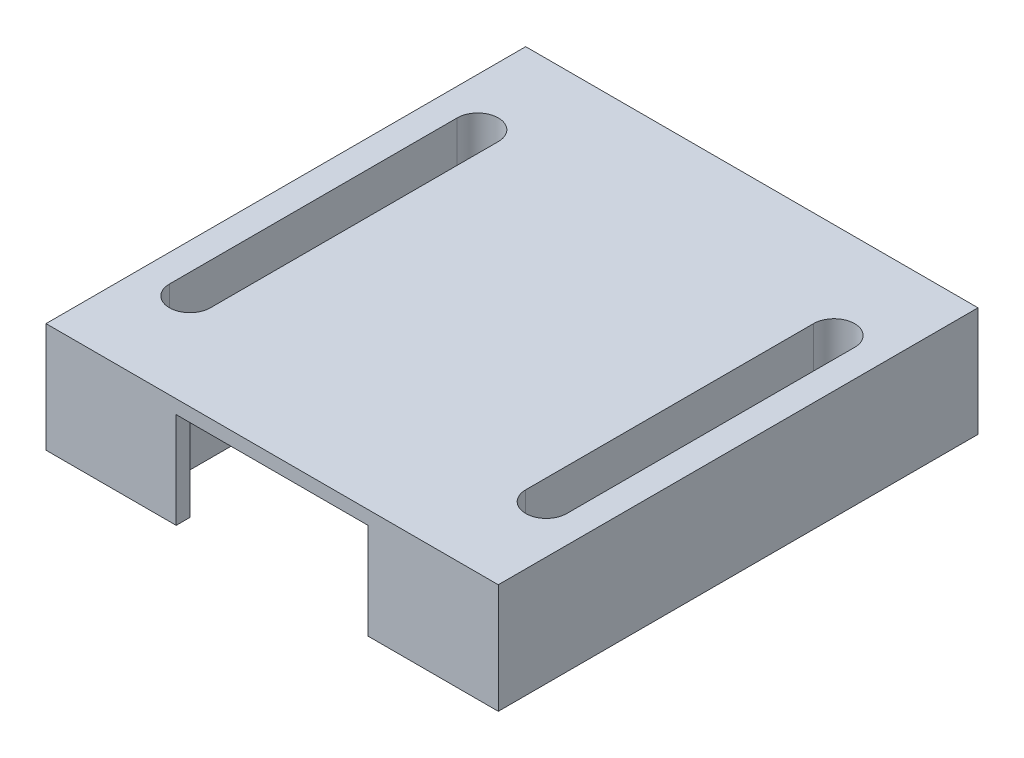
ISO-10303-21;
HEADER;
FILE_DESCRIPTION(('STEP AP214'),'2;1');
FILE_NAME('part.step','',(''),(''),'','','');
FILE_SCHEMA(('AUTOMOTIVE_DESIGN { 1 0 10303 214 1 1 1 1 }'));
ENDSEC;
DATA;
#1=APPLICATION_CONTEXT('core data for automotive mechanical design processes');
#2=APPLICATION_PROTOCOL_DEFINITION('international standard','automotive_design',2000,#1);
#3=PRODUCT_CONTEXT('',#1,'mechanical');
#4=PRODUCT('Part','Part','',(#3));
#5=PRODUCT_RELATED_PRODUCT_CATEGORY('part','',(#4));
#6=PRODUCT_DEFINITION_FORMATION('','',#4);
#7=PRODUCT_DEFINITION_CONTEXT('part definition',#1,'design');
#8=PRODUCT_DEFINITION('design','',#6,#7);
#9=PRODUCT_DEFINITION_SHAPE('','',#8);
#10=(LENGTH_UNIT() NAMED_UNIT(*) SI_UNIT(.MILLI.,.METRE.));
#11=(NAMED_UNIT(*) PLANE_ANGLE_UNIT() SI_UNIT($,.RADIAN.));
#12=(NAMED_UNIT(*) SI_UNIT($,.STERADIAN.) SOLID_ANGLE_UNIT());
#13=UNCERTAINTY_MEASURE_WITH_UNIT(LENGTH_MEASURE(1.E-05),#10,'distance_accuracy_value','');
#14=(GEOMETRIC_REPRESENTATION_CONTEXT(3) GLOBAL_UNCERTAINTY_ASSIGNED_CONTEXT((#13)) GLOBAL_UNIT_ASSIGNED_CONTEXT((#10,
#11,#12)) REPRESENTATION_CONTEXT('',''));
#15=CARTESIAN_POINT('',(0.,0.,0.));
#16=DIRECTION('',(0.,0.,1.));
#17=DIRECTION('',(1.,0.,0.));
#18=AXIS2_PLACEMENT_3D('',#15,#16,#17);
#19=CARTESIAN_POINT('',(-10.,7.,16.5));
#20=DIRECTION('',(0.,0.,1.));
#21=DIRECTION('',(1.,0.,0.));
#22=AXIS2_PLACEMENT_3D('',#19,#20,#21);
#23=PLANE('',#22);
#24=DIRECTION('',(-1.,0.,0.));
#25=VECTOR('',#24,1.);
#26=CARTESIAN_POINT('',(-10.,7.,16.5));
#27=LINE('',#26,#25);
#28=CARTESIAN_POINT('',(-7.,7.,16.5));
#29=VERTEX_POINT('',#28);
#30=CARTESIAN_POINT('',(-10.,7.,16.5));
#31=VERTEX_POINT('',#30);
#32=EDGE_CURVE('E261',#29,#31,#27,.T.);
#33=ORIENTED_EDGE('',*,*,#32,.F.);
#34=DIRECTION('',(0.,-1.,0.));
#35=VECTOR('',#34,1.);
#36=CARTESIAN_POINT('',(-7.,7.,16.5));
#37=LINE('',#36,#35);
#38=CARTESIAN_POINT('',(-7.,0.,16.5));
#39=VERTEX_POINT('',#38);
#40=EDGE_CURVE('E286',#29,#39,#37,.T.);
#41=ORIENTED_EDGE('',*,*,#40,.T.);
#42=DIRECTION('',(-1.,0.,0.));
#43=VECTOR('',#42,1.);
#44=CARTESIAN_POINT('',(-10.,0.,16.5));
#45=LINE('',#44,#43);
#46=CARTESIAN_POINT('',(-10.,0.,16.5));
#47=VERTEX_POINT('',#46);
#48=EDGE_CURVE('E190',#39,#47,#45,.T.);
#49=ORIENTED_EDGE('',*,*,#48,.T.);
#50=DIRECTION('',(0.,-1.,0.));
#51=VECTOR('',#50,1.);
#52=CARTESIAN_POINT('',(-10.,7.,16.5));
#53=LINE('',#52,#51);
#54=EDGE_CURVE('E233',#31,#47,#53,.T.);
#55=ORIENTED_EDGE('',*,*,#54,.F.);
#56=EDGE_LOOP('',(#33,#41,#49,#55));
#57=FACE_BOUND('',#56,.T.);
#58=ADVANCED_FACE('F33',(#57),#23,.F.);
#59=CARTESIAN_POINT('',(16.5,8.,17.5));
#60=DIRECTION('',(-1.,0.,0.));
#61=DIRECTION('',(0.,0.,1.));
#62=AXIS2_PLACEMENT_3D('',#59,#60,#61);
#63=PLANE('',#62);
#64=DIRECTION('',(0.,0.,-1.));
#65=VECTOR('',#64,1.);
#66=CARTESIAN_POINT('',(16.5,0.,17.5));
#67=LINE('',#66,#65);
#68=CARTESIAN_POINT('',(16.5,0.,17.5));
#69=VERTEX_POINT('',#68);
#70=CARTESIAN_POINT('',(16.5,0.,-17.5));
#71=VERTEX_POINT('',#70);
#72=EDGE_CURVE('E222',#69,#71,#67,.T.);
#73=ORIENTED_EDGE('',*,*,#72,.T.);
#74=DIRECTION('',(0.,-1.,0.));
#75=VECTOR('',#74,1.);
#76=CARTESIAN_POINT('',(16.5,8.,-17.5));
#77=LINE('',#76,#75);
#78=CARTESIAN_POINT('',(16.5,8.,-17.5));
#79=VERTEX_POINT('',#78);
#80=EDGE_CURVE('E11',#79,#71,#77,.T.);
#81=ORIENTED_EDGE('',*,*,#80,.F.);
#82=DIRECTION('',(0.,0.,-1.));
#83=VECTOR('',#82,1.);
#84=CARTESIAN_POINT('',(16.5,8.,17.5));
#85=LINE('',#84,#83);
#86=CARTESIAN_POINT('',(16.5,8.,17.5));
#87=VERTEX_POINT('',#86);
#88=EDGE_CURVE('E199',#87,#79,#85,.T.);
#89=ORIENTED_EDGE('',*,*,#88,.F.);
#90=DIRECTION('',(0.,-1.,0.));
#91=VECTOR('',#90,1.);
#92=CARTESIAN_POINT('',(16.5,8.,17.5));
#93=LINE('',#92,#91);
#94=EDGE_CURVE('E209',#87,#69,#93,.T.);
#95=ORIENTED_EDGE('',*,*,#94,.T.);
#96=EDGE_LOOP('',(#73,#81,#89,#95));
#97=FACE_BOUND('',#96,.T.);
#98=ADVANCED_FACE('F35',(#97),#63,.F.);
#99=CARTESIAN_POINT('',(-16.5,8.,-17.5));
#100=DIRECTION('',(0.,0.,1.));
#101=DIRECTION('',(1.,0.,0.));
#102=AXIS2_PLACEMENT_3D('',#99,#100,#101);
#103=PLANE('',#102);
#104=DIRECTION('',(-1.,0.,0.));
#105=VECTOR('',#104,1.);
#106=CARTESIAN_POINT('',(-16.5,0.,-17.5));
#107=LINE('',#106,#105);
#108=CARTESIAN_POINT('',(-16.5,0.,-17.5));
#109=VERTEX_POINT('',#108);
#110=EDGE_CURVE('E221',#71,#109,#107,.T.);
#111=ORIENTED_EDGE('',*,*,#110,.T.);
#112=DIRECTION('',(0.,-1.,0.));
#113=VECTOR('',#112,1.);
#114=CARTESIAN_POINT('',(-16.5,8.,-17.5));
#115=LINE('',#114,#113);
#116=CARTESIAN_POINT('',(-16.5,8.,-17.5));
#117=VERTEX_POINT('',#116);
#118=EDGE_CURVE('E41',#117,#109,#115,.T.);
#119=ORIENTED_EDGE('',*,*,#118,.F.);
#120=DIRECTION('',(-1.,0.,0.));
#121=VECTOR('',#120,1.);
#122=CARTESIAN_POINT('',(-16.5,8.,-17.5));
#123=LINE('',#122,#121);
#124=EDGE_CURVE('E203',#79,#117,#123,.T.);
#125=ORIENTED_EDGE('',*,*,#124,.F.);
#126=ORIENTED_EDGE('',*,*,#80,.T.);
#127=EDGE_LOOP('',(#111,#119,#125,#126));
#128=FACE_BOUND('',#127,.T.);
#129=ADVANCED_FACE('F352',(#128),#103,.F.);
#130=CARTESIAN_POINT('',(-16.5,8.,17.5));
#131=DIRECTION('',(1.,0.,0.));
#132=DIRECTION('',(0.,0.,-1.));
#133=AXIS2_PLACEMENT_3D('',#130,#131,#132);
#134=PLANE('',#133);
#135=DIRECTION('',(0.,0.,1.));
#136=VECTOR('',#135,1.);
#137=CARTESIAN_POINT('',(-16.5,0.,17.5));
#138=LINE('',#137,#136);
#139=CARTESIAN_POINT('',(-16.5,0.,17.5));
#140=VERTEX_POINT('',#139);
#141=EDGE_CURVE('E205',#109,#140,#138,.T.);
#142=ORIENTED_EDGE('',*,*,#141,.T.);
#143=DIRECTION('',(0.,-1.,0.));
#144=VECTOR('',#143,1.);
#145=CARTESIAN_POINT('',(-16.5,8.,17.5));
#146=LINE('',#145,#144);
#147=CARTESIAN_POINT('',(-16.5,8.,17.5));
#148=VERTEX_POINT('',#147);
#149=EDGE_CURVE('E198',#148,#140,#146,.T.);
#150=ORIENTED_EDGE('',*,*,#149,.F.);
#151=DIRECTION('',(0.,0.,1.));
#152=VECTOR('',#151,1.);
#153=CARTESIAN_POINT('',(-16.5,8.,17.5));
#154=LINE('',#153,#152);
#155=EDGE_CURVE('E218',#117,#148,#154,.T.);
#156=ORIENTED_EDGE('',*,*,#155,.F.);
#157=ORIENTED_EDGE('',*,*,#118,.T.);
#158=EDGE_LOOP('',(#142,#150,#156,#157));
#159=FACE_BOUND('',#158,.T.);
#160=ADVANCED_FACE('F217',(#159),#134,.F.);
#161=CARTESIAN_POINT('',(-16.5,8.,17.5));
#162=DIRECTION('',(0.,0.,-1.));
#163=DIRECTION('',(-1.,0.,0.));
#164=AXIS2_PLACEMENT_3D('',#161,#162,#163);
#165=PLANE('',#164);
#166=DIRECTION('',(1.,0.,0.));
#167=VECTOR('',#166,1.);
#168=CARTESIAN_POINT('',(-16.5,0.,17.5));
#169=LINE('',#168,#167);
#170=CARTESIAN_POINT('',(-7.,0.,17.5));
#171=VERTEX_POINT('',#170);
#172=EDGE_CURVE('E188',#140,#171,#169,.T.);
#173=ORIENTED_EDGE('',*,*,#172,.T.);
#174=DIRECTION('',(0.,-1.,0.));
#175=VECTOR('',#174,1.);
#176=CARTESIAN_POINT('',(-7.,7.,17.5));
#177=LINE('',#176,#175);
#178=CARTESIAN_POINT('',(-7.,7.,17.5));
#179=VERTEX_POINT('',#178);
#180=EDGE_CURVE('E169',#179,#171,#177,.T.);
#181=ORIENTED_EDGE('',*,*,#180,.F.);
#182=DIRECTION('',(-1.,0.,0.));
#183=VECTOR('',#182,1.);
#184=CARTESIAN_POINT('',(7.,7.,17.5));
#185=LINE('',#184,#183);
#186=CARTESIAN_POINT('',(7.,7.,17.5));
#187=VERTEX_POINT('',#186);
#188=EDGE_CURVE('E192',#187,#179,#185,.T.);
#189=ORIENTED_EDGE('',*,*,#188,.F.);
#190=DIRECTION('',(0.,1.,0.));
#191=VECTOR('',#190,1.);
#192=CARTESIAN_POINT('',(7.,7.,17.5));
#193=LINE('',#192,#191);
#194=CARTESIAN_POINT('',(7.,0.,17.5));
#195=VERTEX_POINT('',#194);
#196=EDGE_CURVE('E180',#195,#187,#193,.T.);
#197=ORIENTED_EDGE('',*,*,#196,.F.);
#198=EDGE_CURVE('E200',#195,#69,#169,.T.);
#199=ORIENTED_EDGE('',*,*,#198,.T.);
#200=ORIENTED_EDGE('',*,*,#94,.F.);
#201=DIRECTION('',(1.,0.,0.));
#202=VECTOR('',#201,1.);
#203=CARTESIAN_POINT('',(-16.5,8.,17.5));
#204=LINE('',#203,#202);
#205=EDGE_CURVE('E212',#148,#87,#204,.T.);
#206=ORIENTED_EDGE('',*,*,#205,.F.);
#207=ORIENTED_EDGE('',*,*,#149,.T.);
#208=EDGE_LOOP('',(#173,#181,#189,#197,#199,#200,#206,#207));
#209=FACE_BOUND('',#208,.T.);
#210=ADVANCED_FACE('F195',(#209),#165,.F.);
#211=CARTESIAN_POINT('',(0.,8.,0.));
#212=DIRECTION('',(0.,-1.,0.));
#213=DIRECTION('',(0.,0.,-1.));
#214=AXIS2_PLACEMENT_3D('',#211,#212,#213);
#215=PLANE('',#214);
#216=DIRECTION('',(0.,0.,1.));
#217=VECTOR('',#216,1.);
#218=CARTESIAN_POINT('',(11.5,8.,-10.5));
#219=LINE('',#218,#217);
#220=CARTESIAN_POINT('',(11.5,8.,-10.5));
#221=VERTEX_POINT('',#220);
#222=CARTESIAN_POINT('',(11.5,8.,10.5));
#223=VERTEX_POINT('',#222);
#224=EDGE_CURVE('E312',#221,#223,#219,.T.);
#225=ORIENTED_EDGE('',*,*,#224,.F.);
#226=CARTESIAN_POINT('',(13.,8.,-10.5));
#227=DIRECTION('',(0.,1.,0.));
#228=DIRECTION('',(0.,0.,1.));
#229=AXIS2_PLACEMENT_3D('',#226,#227,#228);
#230=CIRCLE('',#229,1.50000000000001);
#231=CARTESIAN_POINT('',(14.5,8.,-10.5));
#232=VERTEX_POINT('',#231);
#233=EDGE_CURVE('E56',#232,#221,#230,.T.);
#234=ORIENTED_EDGE('',*,*,#233,.F.);
#235=DIRECTION('',(0.,0.,-1.));
#236=VECTOR('',#235,1.);
#237=CARTESIAN_POINT('',(14.5,8.,-10.5));
#238=LINE('',#237,#236);
#239=CARTESIAN_POINT('',(14.5,8.,10.5));
#240=VERTEX_POINT('',#239);
#241=EDGE_CURVE('E305',#240,#232,#238,.T.);
#242=ORIENTED_EDGE('',*,*,#241,.F.);
#243=CARTESIAN_POINT('',(13.,8.,10.5));
#244=DIRECTION('',(0.,1.,0.));
#245=DIRECTION('',(0.,0.,1.));
#246=AXIS2_PLACEMENT_3D('',#243,#244,#245);
#247=CIRCLE('',#246,1.50000000000001);
#248=EDGE_CURVE('E309',#223,#240,#247,.T.);
#249=ORIENTED_EDGE('',*,*,#248,.F.);
#250=EDGE_LOOP('',(#225,#234,#242,#249));
#251=FACE_BOUND('',#250,.T.);
#252=DIRECTION('',(0.,0.,1.));
#253=VECTOR('',#252,1.);
#254=CARTESIAN_POINT('',(-14.5,8.,-10.5));
#255=LINE('',#254,#253);
#256=CARTESIAN_POINT('',(-14.5,8.,-10.5));
#257=VERTEX_POINT('',#256);
#258=CARTESIAN_POINT('',(-14.5,8.,10.5));
#259=VERTEX_POINT('',#258);
#260=EDGE_CURVE('E281',#257,#259,#255,.T.);
#261=ORIENTED_EDGE('',*,*,#260,.F.);
#262=CARTESIAN_POINT('',(-13.,8.,-10.5));
#263=DIRECTION('',(0.,1.,0.));
#264=DIRECTION('',(0.,0.,-1.));
#265=AXIS2_PLACEMENT_3D('',#262,#263,#264);
#266=CIRCLE('',#265,1.50000000000001);
#267=CARTESIAN_POINT('',(-11.5,8.,-10.5));
#268=VERTEX_POINT('',#267);
#269=EDGE_CURVE('E284',#268,#257,#266,.T.);
#270=ORIENTED_EDGE('',*,*,#269,.F.);
#271=DIRECTION('',(0.,0.,-1.));
#272=VECTOR('',#271,1.);
#273=CARTESIAN_POINT('',(-11.5,8.,-10.5));
#274=LINE('',#273,#272);
#275=CARTESIAN_POINT('',(-11.5,8.,10.5));
#276=VERTEX_POINT('',#275);
#277=EDGE_CURVE('E274',#276,#268,#274,.T.);
#278=ORIENTED_EDGE('',*,*,#277,.F.);
#279=CARTESIAN_POINT('',(-13.,8.,10.5));
#280=DIRECTION('',(0.,1.,0.));
#281=DIRECTION('',(0.,0.,-1.));
#282=AXIS2_PLACEMENT_3D('',#279,#280,#281);
#283=CIRCLE('',#282,1.50000000000001);
#284=EDGE_CURVE('E278',#259,#276,#283,.T.);
#285=ORIENTED_EDGE('',*,*,#284,.F.);
#286=EDGE_LOOP('',(#261,#270,#278,#285));
#287=FACE_BOUND('',#286,.T.);
#288=ORIENTED_EDGE('',*,*,#88,.T.);
#289=ORIENTED_EDGE('',*,*,#124,.T.);
#290=ORIENTED_EDGE('',*,*,#155,.T.);
#291=ORIENTED_EDGE('',*,*,#205,.T.);
#292=EDGE_LOOP('',(#288,#289,#290,#291));
#293=FACE_BOUND('',#292,.T.);
#294=ADVANCED_FACE('F351',(#251,#287,#293),#215,.F.);
#295=CARTESIAN_POINT('',(0.,0.,0.));
#296=DIRECTION('',(0.,-1.,0.));
#297=DIRECTION('',(0.,0.,-1.));
#298=AXIS2_PLACEMENT_3D('',#295,#296,#297);
#299=PLANE('',#298);
#300=DIRECTION('',(0.,0.,1.));
#301=VECTOR('',#300,1.);
#302=CARTESIAN_POINT('',(-7.,0.,10.5));
#303=LINE('',#302,#301);
#304=EDGE_CURVE('E172',#39,#171,#303,.T.);
#305=ORIENTED_EDGE('',*,*,#304,.T.);
#306=ORIENTED_EDGE('',*,*,#172,.F.);
#307=ORIENTED_EDGE('',*,*,#141,.F.);
#308=ORIENTED_EDGE('',*,*,#110,.F.);
#309=ORIENTED_EDGE('',*,*,#72,.F.);
#310=ORIENTED_EDGE('',*,*,#198,.F.);
#311=DIRECTION('',(0.,0.,1.));
#312=VECTOR('',#311,1.);
#313=CARTESIAN_POINT('',(7.,0.,10.5));
#314=LINE('',#313,#312);
#315=CARTESIAN_POINT('',(7.,0.,16.5));
#316=VERTEX_POINT('',#315);
#317=EDGE_CURVE('E191',#316,#195,#314,.T.);
#318=ORIENTED_EDGE('',*,*,#317,.F.);
#319=CARTESIAN_POINT('',(10.,0.,16.5));
#320=VERTEX_POINT('',#319);
#321=EDGE_CURVE('E247',#320,#316,#45,.T.);
#322=ORIENTED_EDGE('',*,*,#321,.F.);
#323=DIRECTION('',(0.,0.,1.));
#324=VECTOR('',#323,1.);
#325=CARTESIAN_POINT('',(10.,0.,16.5));
#326=LINE('',#325,#324);
#327=CARTESIAN_POINT('',(10.,0.,-16.5));
#328=VERTEX_POINT('',#327);
#329=EDGE_CURVE('E250',#328,#320,#326,.T.);
#330=ORIENTED_EDGE('',*,*,#329,.F.);
#331=DIRECTION('',(1.,0.,0.));
#332=VECTOR('',#331,1.);
#333=CARTESIAN_POINT('',(-10.,0.,-16.5));
#334=LINE('',#333,#332);
#335=CARTESIAN_POINT('',(-10.,0.,-16.5));
#336=VERTEX_POINT('',#335);
#337=EDGE_CURVE('E240',#336,#328,#334,.T.);
#338=ORIENTED_EDGE('',*,*,#337,.F.);
#339=DIRECTION('',(0.,0.,-1.));
#340=VECTOR('',#339,1.);
#341=CARTESIAN_POINT('',(-10.,0.,16.5));
#342=LINE('',#341,#340);
#343=EDGE_CURVE('E244',#47,#336,#342,.T.);
#344=ORIENTED_EDGE('',*,*,#343,.F.);
#345=ORIENTED_EDGE('',*,*,#48,.F.);
#346=EDGE_LOOP('',(#305,#306,#307,#308,#309,#310,#318,#322,#330,#338,#344,#345));
#347=FACE_BOUND('',#346,.T.);
#348=CARTESIAN_POINT('',(13.,0.,-10.5));
#349=DIRECTION('',(0.,1.,0.));
#350=DIRECTION('',(0.,0.,1.));
#351=AXIS2_PLACEMENT_3D('',#348,#349,#350);
#352=CIRCLE('',#351,1.50000000000001);
#353=CARTESIAN_POINT('',(14.5,0.,-10.5));
#354=VERTEX_POINT('',#353);
#355=CARTESIAN_POINT('',(11.5,0.,-10.5));
#356=VERTEX_POINT('',#355);
#357=EDGE_CURVE('E308',#354,#356,#352,.T.);
#358=ORIENTED_EDGE('',*,*,#357,.T.);
#359=DIRECTION('',(0.,0.,1.));
#360=VECTOR('',#359,1.);
#361=CARTESIAN_POINT('',(11.5,0.,-10.5));
#362=LINE('',#361,#360);
#363=CARTESIAN_POINT('',(11.5,0.,10.5));
#364=VERTEX_POINT('',#363);
#365=EDGE_CURVE('E321',#356,#364,#362,.T.);
#366=ORIENTED_EDGE('',*,*,#365,.T.);
#367=CARTESIAN_POINT('',(13.,0.,10.5));
#368=DIRECTION('',(0.,1.,0.));
#369=DIRECTION('',(0.,0.,1.));
#370=AXIS2_PLACEMENT_3D('',#367,#368,#369);
#371=CIRCLE('',#370,1.50000000000001);
#372=CARTESIAN_POINT('',(14.5,0.,10.5));
#373=VERTEX_POINT('',#372);
#374=EDGE_CURVE('E318',#364,#373,#371,.T.);
#375=ORIENTED_EDGE('',*,*,#374,.T.);
#376=DIRECTION('',(0.,0.,-1.));
#377=VECTOR('',#376,1.);
#378=CARTESIAN_POINT('',(14.5,0.,-10.5));
#379=LINE('',#378,#377);
#380=EDGE_CURVE('E300',#373,#354,#379,.T.);
#381=ORIENTED_EDGE('',*,*,#380,.T.);
#382=EDGE_LOOP('',(#358,#366,#375,#381));
#383=FACE_BOUND('',#382,.T.);
#384=CARTESIAN_POINT('',(-13.,0.,-10.5));
#385=DIRECTION('',(0.,1.,0.));
#386=DIRECTION('',(0.,0.,-1.));
#387=AXIS2_PLACEMENT_3D('',#384,#385,#386);
#388=CIRCLE('',#387,1.50000000000001);
#389=CARTESIAN_POINT('',(-11.5,0.,-10.5));
#390=VERTEX_POINT('',#389);
#391=CARTESIAN_POINT('',(-14.5,0.,-10.5));
#392=VERTEX_POINT('',#391);
#393=EDGE_CURVE('E277',#390,#392,#388,.T.);
#394=ORIENTED_EDGE('',*,*,#393,.T.);
#395=DIRECTION('',(0.,0.,1.));
#396=VECTOR('',#395,1.);
#397=CARTESIAN_POINT('',(-14.5,0.,-10.5));
#398=LINE('',#397,#396);
#399=CARTESIAN_POINT('',(-14.5,0.,10.5));
#400=VERTEX_POINT('',#399);
#401=EDGE_CURVE('E292',#392,#400,#398,.T.);
#402=ORIENTED_EDGE('',*,*,#401,.T.);
#403=CARTESIAN_POINT('',(-13.,0.,10.5));
#404=DIRECTION('',(0.,1.,0.));
#405=DIRECTION('',(0.,0.,-1.));
#406=AXIS2_PLACEMENT_3D('',#403,#404,#405);
#407=CIRCLE('',#406,1.50000000000001);
#408=CARTESIAN_POINT('',(-11.5,0.,10.5));
#409=VERTEX_POINT('',#408);
#410=EDGE_CURVE('E289',#400,#409,#407,.T.);
#411=ORIENTED_EDGE('',*,*,#410,.T.);
#412=DIRECTION('',(0.,0.,-1.));
#413=VECTOR('',#412,1.);
#414=CARTESIAN_POINT('',(-11.5,0.,-10.5));
#415=LINE('',#414,#413);
#416=EDGE_CURVE('E268',#409,#390,#415,.T.);
#417=ORIENTED_EDGE('',*,*,#416,.T.);
#418=EDGE_LOOP('',(#394,#402,#411,#417));
#419=FACE_BOUND('',#418,.T.);
#420=ADVANCED_FACE('F185',(#347,#383,#419),#299,.T.);
#421=CARTESIAN_POINT('',(10.,7.,16.5));
#422=DIRECTION('',(1.,0.,0.));
#423=DIRECTION('',(0.,0.,-1.));
#424=AXIS2_PLACEMENT_3D('',#421,#422,#423);
#425=PLANE('',#424);
#426=ORIENTED_EDGE('',*,*,#329,.T.);
#427=DIRECTION('',(0.,-1.,0.));
#428=VECTOR('',#427,1.);
#429=CARTESIAN_POINT('',(10.,7.,16.5));
#430=LINE('',#429,#428);
#431=CARTESIAN_POINT('',(10.,7.,16.5));
#432=VERTEX_POINT('',#431);
#433=EDGE_CURVE('E230',#432,#320,#430,.T.);
#434=ORIENTED_EDGE('',*,*,#433,.F.);
#435=DIRECTION('',(0.,0.,1.));
#436=VECTOR('',#435,1.);
#437=CARTESIAN_POINT('',(10.,7.,16.5));
#438=LINE('',#437,#436);
#439=CARTESIAN_POINT('',(10.,7.,-16.5));
#440=VERTEX_POINT('',#439);
#441=EDGE_CURVE('E243',#440,#432,#438,.T.);
#442=ORIENTED_EDGE('',*,*,#441,.F.);
#443=DIRECTION('',(0.,-1.,0.));
#444=VECTOR('',#443,1.);
#445=CARTESIAN_POINT('',(10.,7.,-16.5));
#446=LINE('',#445,#444);
#447=EDGE_CURVE('E224',#440,#328,#446,.T.);
#448=ORIENTED_EDGE('',*,*,#447,.T.);
#449=EDGE_LOOP('',(#426,#434,#442,#448));
#450=FACE_BOUND('',#449,.T.);
#451=ADVANCED_FACE('F379',(#450),#425,.F.);
#452=CARTESIAN_POINT('',(-10.,7.,-16.5));
#453=DIRECTION('',(0.,0.,-1.));
#454=DIRECTION('',(-1.,0.,0.));
#455=AXIS2_PLACEMENT_3D('',#452,#453,#454);
#456=PLANE('',#455);
#457=ORIENTED_EDGE('',*,*,#337,.T.);
#458=ORIENTED_EDGE('',*,*,#447,.F.);
#459=DIRECTION('',(1.,0.,0.));
#460=VECTOR('',#459,1.);
#461=CARTESIAN_POINT('',(-10.,7.,-16.5));
#462=LINE('',#461,#460);
#463=CARTESIAN_POINT('',(-10.,7.,-16.5));
#464=VERTEX_POINT('',#463);
#465=EDGE_CURVE('E234',#464,#440,#462,.T.);
#466=ORIENTED_EDGE('',*,*,#465,.F.);
#467=DIRECTION('',(0.,-1.,0.));
#468=VECTOR('',#467,1.);
#469=CARTESIAN_POINT('',(-10.,7.,-16.5));
#470=LINE('',#469,#468);
#471=EDGE_CURVE('E237',#464,#336,#470,.T.);
#472=ORIENTED_EDGE('',*,*,#471,.T.);
#473=EDGE_LOOP('',(#457,#458,#466,#472));
#474=FACE_BOUND('',#473,.T.);
#475=ADVANCED_FACE('F374',(#474),#456,.F.);
#476=CARTESIAN_POINT('',(-10.,7.,16.5));
#477=DIRECTION('',(-1.,0.,0.));
#478=DIRECTION('',(0.,0.,1.));
#479=AXIS2_PLACEMENT_3D('',#476,#477,#478);
#480=PLANE('',#479);
#481=ORIENTED_EDGE('',*,*,#343,.T.);
#482=ORIENTED_EDGE('',*,*,#471,.F.);
#483=DIRECTION('',(0.,0.,-1.));
#484=VECTOR('',#483,1.);
#485=CARTESIAN_POINT('',(-10.,7.,16.5));
#486=LINE('',#485,#484);
#487=EDGE_CURVE('E255',#31,#464,#486,.T.);
#488=ORIENTED_EDGE('',*,*,#487,.F.);
#489=ORIENTED_EDGE('',*,*,#54,.T.);
#490=EDGE_LOOP('',(#481,#482,#488,#489));
#491=FACE_BOUND('',#490,.T.);
#492=ADVANCED_FACE('F367',(#491),#480,.F.);
#493=ORIENTED_EDGE('',*,*,#321,.T.);
#494=DIRECTION('',(0.,1.,0.));
#495=VECTOR('',#494,1.);
#496=CARTESIAN_POINT('',(7.,7.,16.5));
#497=LINE('',#496,#495);
#498=CARTESIAN_POINT('',(7.,7.,16.5));
#499=VERTEX_POINT('',#498);
#500=EDGE_CURVE('E327',#316,#499,#497,.T.);
#501=ORIENTED_EDGE('',*,*,#500,.T.);
#502=EDGE_CURVE('E258',#432,#499,#27,.T.);
#503=ORIENTED_EDGE('',*,*,#502,.F.);
#504=ORIENTED_EDGE('',*,*,#433,.T.);
#505=EDGE_LOOP('',(#493,#501,#503,#504));
#506=FACE_BOUND('',#505,.T.);
#507=ADVANCED_FACE('F343',(#506),#23,.F.);
#508=CARTESIAN_POINT('',(0.,7.,0.));
#509=DIRECTION('',(0.,-1.,0.));
#510=DIRECTION('',(0.,0.,-1.));
#511=AXIS2_PLACEMENT_3D('',#508,#509,#510);
#512=PLANE('',#511);
#513=ORIENTED_EDGE('',*,*,#502,.T.);
#514=DIRECTION('',(0.,0.,1.));
#515=VECTOR('',#514,1.);
#516=CARTESIAN_POINT('',(7.,7.,10.5));
#517=LINE('',#516,#515);
#518=EDGE_CURVE('E48',#499,#187,#517,.T.);
#519=ORIENTED_EDGE('',*,*,#518,.T.);
#520=ORIENTED_EDGE('',*,*,#188,.T.);
#521=DIRECTION('',(0.,0.,1.));
#522=VECTOR('',#521,1.);
#523=CARTESIAN_POINT('',(-7.,7.,10.5));
#524=LINE('',#523,#522);
#525=EDGE_CURVE('E175',#29,#179,#524,.T.);
#526=ORIENTED_EDGE('',*,*,#525,.F.);
#527=ORIENTED_EDGE('',*,*,#32,.T.);
#528=ORIENTED_EDGE('',*,*,#487,.T.);
#529=ORIENTED_EDGE('',*,*,#465,.T.);
#530=ORIENTED_EDGE('',*,*,#441,.T.);
#531=EDGE_LOOP('',(#513,#519,#520,#526,#527,#528,#529,#530));
#532=FACE_BOUND('',#531,.T.);
#533=ADVANCED_FACE('F338',(#532),#512,.T.);
#534=CARTESIAN_POINT('',(-13.,0.,-10.5));
#535=DIRECTION('',(0.,1.,0.));
#536=DIRECTION('',(0.,0.,1.));
#537=AXIS2_PLACEMENT_3D('',#534,#535,#536);
#538=CYLINDRICAL_SURFACE('',#537,1.50000000000001);
#539=ORIENTED_EDGE('',*,*,#269,.T.);
#540=DIRECTION('',(0.,1.,0.));
#541=VECTOR('',#540,1.);
#542=CARTESIAN_POINT('',(-14.5,0.,-10.5));
#543=LINE('',#542,#541);
#544=EDGE_CURVE('E264',#392,#257,#543,.T.);
#545=ORIENTED_EDGE('',*,*,#544,.F.);
#546=ORIENTED_EDGE('',*,*,#393,.F.);
#547=DIRECTION('',(0.,1.,0.));
#548=VECTOR('',#547,1.);
#549=CARTESIAN_POINT('',(-11.5,0.,-10.5));
#550=LINE('',#549,#548);
#551=EDGE_CURVE('E272',#390,#268,#550,.T.);
#552=ORIENTED_EDGE('',*,*,#551,.T.);
#553=EDGE_LOOP('',(#539,#545,#546,#552));
#554=FACE_BOUND('',#553,.T.);
#555=ADVANCED_FACE('F372',(#554),#538,.F.);
#556=CARTESIAN_POINT('',(-11.5,0.,-10.5));
#557=DIRECTION('',(1.,0.,0.));
#558=DIRECTION('',(0.,0.,-1.));
#559=AXIS2_PLACEMENT_3D('',#556,#557,#558);
#560=PLANE('',#559);
#561=ORIENTED_EDGE('',*,*,#277,.T.);
#562=ORIENTED_EDGE('',*,*,#551,.F.);
#563=ORIENTED_EDGE('',*,*,#416,.F.);
#564=DIRECTION('',(0.,1.,0.));
#565=VECTOR('',#564,1.);
#566=CARTESIAN_POINT('',(-11.5,0.,10.5));
#567=LINE('',#566,#565);
#568=EDGE_CURVE('E270',#409,#276,#567,.T.);
#569=ORIENTED_EDGE('',*,*,#568,.T.);
#570=EDGE_LOOP('',(#561,#562,#563,#569));
#571=FACE_BOUND('',#570,.T.);
#572=ADVANCED_FACE('F385',(#571),#560,.F.);
#573=CARTESIAN_POINT('',(-13.,0.,10.5));
#574=DIRECTION('',(0.,1.,0.));
#575=DIRECTION('',(0.,0.,1.));
#576=AXIS2_PLACEMENT_3D('',#573,#574,#575);
#577=CYLINDRICAL_SURFACE('',#576,1.50000000000001);
#578=ORIENTED_EDGE('',*,*,#284,.T.);
#579=ORIENTED_EDGE('',*,*,#568,.F.);
#580=ORIENTED_EDGE('',*,*,#410,.F.);
#581=DIRECTION('',(0.,1.,0.));
#582=VECTOR('',#581,1.);
#583=CARTESIAN_POINT('',(-14.5,0.,10.5));
#584=LINE('',#583,#582);
#585=EDGE_CURVE('E267',#400,#259,#584,.T.);
#586=ORIENTED_EDGE('',*,*,#585,.T.);
#587=EDGE_LOOP('',(#578,#579,#580,#586));
#588=FACE_BOUND('',#587,.T.);
#589=ADVANCED_FACE('F391',(#588),#577,.F.);
#590=CARTESIAN_POINT('',(-14.5,0.,-10.5));
#591=DIRECTION('',(-1.,0.,0.));
#592=DIRECTION('',(0.,0.,1.));
#593=AXIS2_PLACEMENT_3D('',#590,#591,#592);
#594=PLANE('',#593);
#595=ORIENTED_EDGE('',*,*,#260,.T.);
#596=ORIENTED_EDGE('',*,*,#585,.F.);
#597=ORIENTED_EDGE('',*,*,#401,.F.);
#598=ORIENTED_EDGE('',*,*,#544,.T.);
#599=EDGE_LOOP('',(#595,#596,#597,#598));
#600=FACE_BOUND('',#599,.T.);
#601=ADVANCED_FACE('F387',(#600),#594,.F.);
#602=CARTESIAN_POINT('',(13.,0.,-10.5));
#603=DIRECTION('',(0.,1.,0.));
#604=DIRECTION('',(0.,0.,1.));
#605=AXIS2_PLACEMENT_3D('',#602,#603,#604);
#606=CYLINDRICAL_SURFACE('',#605,1.50000000000001);
#607=ORIENTED_EDGE('',*,*,#233,.T.);
#608=DIRECTION('',(0.,1.,0.));
#609=VECTOR('',#608,1.);
#610=CARTESIAN_POINT('',(11.5,0.,-10.5));
#611=LINE('',#610,#609);
#612=EDGE_CURVE('E297',#356,#221,#611,.T.);
#613=ORIENTED_EDGE('',*,*,#612,.F.);
#614=ORIENTED_EDGE('',*,*,#357,.F.);
#615=DIRECTION('',(0.,1.,0.));
#616=VECTOR('',#615,1.);
#617=CARTESIAN_POINT('',(14.5,0.,-10.5));
#618=LINE('',#617,#616);
#619=EDGE_CURVE('E252',#354,#232,#618,.T.);
#620=ORIENTED_EDGE('',*,*,#619,.T.);
#621=EDGE_LOOP('',(#607,#613,#614,#620));
#622=FACE_BOUND('',#621,.T.);
#623=ADVANCED_FACE('F390',(#622),#606,.F.);
#624=CARTESIAN_POINT('',(14.5,0.,-10.5));
#625=DIRECTION('',(1.,0.,0.));
#626=DIRECTION('',(0.,0.,-1.));
#627=AXIS2_PLACEMENT_3D('',#624,#625,#626);
#628=PLANE('',#627);
#629=ORIENTED_EDGE('',*,*,#241,.T.);
#630=ORIENTED_EDGE('',*,*,#619,.F.);
#631=ORIENTED_EDGE('',*,*,#380,.F.);
#632=DIRECTION('',(0.,1.,0.));
#633=VECTOR('',#632,1.);
#634=CARTESIAN_POINT('',(14.5,0.,10.5));
#635=LINE('',#634,#633);
#636=EDGE_CURVE('E302',#373,#240,#635,.T.);
#637=ORIENTED_EDGE('',*,*,#636,.T.);
#638=EDGE_LOOP('',(#629,#630,#631,#637));
#639=FACE_BOUND('',#638,.T.);
#640=ADVANCED_FACE('F401',(#639),#628,.F.);
#641=CARTESIAN_POINT('',(13.,0.,10.5));
#642=DIRECTION('',(0.,1.,0.));
#643=DIRECTION('',(0.,0.,1.));
#644=AXIS2_PLACEMENT_3D('',#641,#642,#643);
#645=CYLINDRICAL_SURFACE('',#644,1.50000000000001);
#646=ORIENTED_EDGE('',*,*,#248,.T.);
#647=ORIENTED_EDGE('',*,*,#636,.F.);
#648=ORIENTED_EDGE('',*,*,#374,.F.);
#649=DIRECTION('',(0.,1.,0.));
#650=VECTOR('',#649,1.);
#651=CARTESIAN_POINT('',(11.5,0.,10.5));
#652=LINE('',#651,#650);
#653=EDGE_CURVE('E299',#364,#223,#652,.T.);
#654=ORIENTED_EDGE('',*,*,#653,.T.);
#655=EDGE_LOOP('',(#646,#647,#648,#654));
#656=FACE_BOUND('',#655,.T.);
#657=ADVANCED_FACE('F405',(#656),#645,.F.);
#658=CARTESIAN_POINT('',(11.5,0.,-10.5));
#659=DIRECTION('',(-1.,0.,0.));
#660=DIRECTION('',(0.,0.,1.));
#661=AXIS2_PLACEMENT_3D('',#658,#659,#660);
#662=PLANE('',#661);
#663=ORIENTED_EDGE('',*,*,#224,.T.);
#664=ORIENTED_EDGE('',*,*,#653,.F.);
#665=ORIENTED_EDGE('',*,*,#365,.F.);
#666=ORIENTED_EDGE('',*,*,#612,.T.);
#667=EDGE_LOOP('',(#663,#664,#665,#666));
#668=FACE_BOUND('',#667,.T.);
#669=ADVANCED_FACE('F402',(#668),#662,.F.);
#670=CARTESIAN_POINT('',(-7.,7.,10.5));
#671=DIRECTION('',(-1.,0.,0.));
#672=DIRECTION('',(0.,-1.,0.));
#673=AXIS2_PLACEMENT_3D('',#670,#671,#672);
#674=PLANE('',#673);
#675=ORIENTED_EDGE('',*,*,#525,.T.);
#676=ORIENTED_EDGE('',*,*,#180,.T.);
#677=ORIENTED_EDGE('',*,*,#304,.F.);
#678=ORIENTED_EDGE('',*,*,#40,.F.);
#679=EDGE_LOOP('',(#675,#676,#677,#678));
#680=FACE_BOUND('',#679,.T.);
#681=ADVANCED_FACE('F171',(#680),#674,.F.);
#682=CARTESIAN_POINT('',(7.,7.,10.5));
#683=DIRECTION('',(1.,0.,0.));
#684=DIRECTION('',(0.,0.,-1.));
#685=AXIS2_PLACEMENT_3D('',#682,#683,#684);
#686=PLANE('',#685);
#687=ORIENTED_EDGE('',*,*,#317,.T.);
#688=ORIENTED_EDGE('',*,*,#196,.T.);
#689=ORIENTED_EDGE('',*,*,#518,.F.);
#690=ORIENTED_EDGE('',*,*,#500,.F.);
#691=EDGE_LOOP('',(#687,#688,#689,#690));
#692=FACE_BOUND('',#691,.T.);
#693=ADVANCED_FACE('F334',(#692),#686,.F.);
#694=CLOSED_SHELL('',(#58,#98,#129,#160,#210,#294,#420,#451,#475,#492,#507,#533,#555,#572,#589,
#601,#623,#640,#657,#669,#681,#693));
#695=MANIFOLD_SOLID_BREP('B2',#694);
#696=ADVANCED_BREP_SHAPE_REPRESENTATION('',(#18,#695),#14);
#697=SHAPE_DEFINITION_REPRESENTATION(#9,#696);
ENDSEC;
END-ISO-10303-21;
